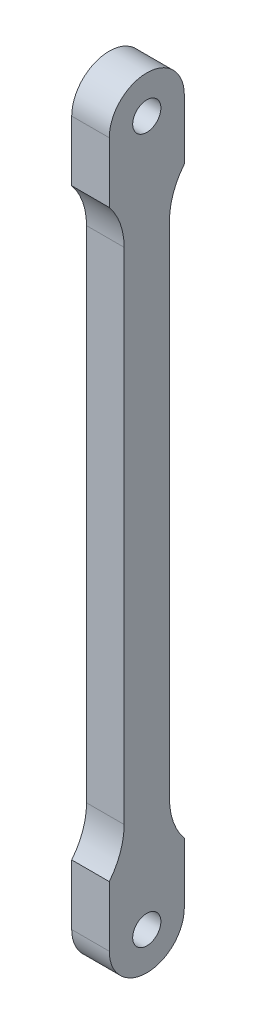
ISO-10303-21;
HEADER;
FILE_DESCRIPTION(('STEP AP214'),'2;1');
FILE_NAME('part.step','',(''),(''),'','','');
FILE_SCHEMA(('AUTOMOTIVE_DESIGN { 1 0 10303 214 1 1 1 1 }'));
ENDSEC;
DATA;
#1=APPLICATION_CONTEXT('core data for automotive mechanical design processes');
#2=APPLICATION_PROTOCOL_DEFINITION('international standard','automotive_design',2000,#1);
#3=PRODUCT_CONTEXT('',#1,'mechanical');
#4=PRODUCT('Part','Part','',(#3));
#5=PRODUCT_RELATED_PRODUCT_CATEGORY('part','',(#4));
#6=PRODUCT_DEFINITION_FORMATION('','',#4);
#7=PRODUCT_DEFINITION_CONTEXT('part definition',#1,'design');
#8=PRODUCT_DEFINITION('design','',#6,#7);
#9=PRODUCT_DEFINITION_SHAPE('','',#8);
#10=(LENGTH_UNIT() NAMED_UNIT(*) SI_UNIT(.MILLI.,.METRE.));
#11=(NAMED_UNIT(*) PLANE_ANGLE_UNIT() SI_UNIT($,.RADIAN.));
#12=(NAMED_UNIT(*) SI_UNIT($,.STERADIAN.) SOLID_ANGLE_UNIT());
#13=UNCERTAINTY_MEASURE_WITH_UNIT(LENGTH_MEASURE(1.E-05),#10,'distance_accuracy_value','');
#14=(GEOMETRIC_REPRESENTATION_CONTEXT(3) GLOBAL_UNCERTAINTY_ASSIGNED_CONTEXT((#13)) GLOBAL_UNIT_ASSIGNED_CONTEXT((#10,
#11,#12)) REPRESENTATION_CONTEXT('',''));
#15=CARTESIAN_POINT('',(0.,0.,0.));
#16=DIRECTION('',(0.,0.,1.));
#17=DIRECTION('',(1.,0.,0.));
#18=AXIS2_PLACEMENT_3D('',#15,#16,#17);
#19=CARTESIAN_POINT('',(13.,85.8493327642219,-30.7854400616336));
#20=DIRECTION('',(0.,0.,-1.));
#21=DIRECTION('',(0.,1.,0.));
#22=AXIS2_PLACEMENT_3D('',#19,#20,#21);
#23=PLANE('',#22);
#24=DIRECTION('',(0.,-1.,0.));
#25=VECTOR('',#24,1.);
#26=CARTESIAN_POINT('',(9.,85.8493327642219,-30.7854400616336));
#27=LINE('',#26,#25);
#28=CARTESIAN_POINT('',(9.,85.8493327642219,-30.7854400616336));
#29=VERTEX_POINT('',#28);
#30=CARTESIAN_POINT('',(9.,79.4265127290062,-30.7854400616336));
#31=VERTEX_POINT('',#30);
#32=EDGE_CURVE('E140',#29,#31,#27,.T.);
#33=ORIENTED_EDGE('',*,*,#32,.T.);
#34=DIRECTION('',(1.,0.,0.));
#35=VECTOR('',#34,1.);
#36=CARTESIAN_POINT('',(9.,79.4265127290062,-30.7854400616336));
#37=LINE('',#36,#35);
#38=CARTESIAN_POINT('',(13.,79.4265127290062,-30.7854400616336));
#39=VERTEX_POINT('',#38);
#40=EDGE_CURVE('E11',#31,#39,#37,.T.);
#41=ORIENTED_EDGE('',*,*,#40,.T.);
#42=DIRECTION('',(0.,-1.,0.));
#43=VECTOR('',#42,1.);
#44=CARTESIAN_POINT('',(13.,85.8493327642219,-30.7854400616336));
#45=LINE('',#44,#43);
#46=CARTESIAN_POINT('',(13.,85.8493327642219,-30.7854400616336));
#47=VERTEX_POINT('',#46);
#48=EDGE_CURVE('E198',#47,#39,#45,.T.);
#49=ORIENTED_EDGE('',*,*,#48,.F.);
#50=DIRECTION('',(-1.,0.,0.));
#51=VECTOR('',#50,1.);
#52=CARTESIAN_POINT('',(13.,85.8493327642219,-30.7854400616336));
#53=LINE('',#52,#51);
#54=EDGE_CURVE('E159',#47,#29,#53,.T.);
#55=ORIENTED_EDGE('',*,*,#54,.T.);
#56=EDGE_LOOP('',(#33,#41,#49,#55));
#57=FACE_BOUND('',#56,.T.);
#58=ADVANCED_FACE('F35',(#57),#23,.F.);
#59=CARTESIAN_POINT('',(13.,85.8493327642219,-38.7735888511973));
#60=DIRECTION('',(0.,0.,1.));
#61=DIRECTION('',(0.,-1.,0.));
#62=AXIS2_PLACEMENT_3D('',#59,#60,#61);
#63=PLANE('',#62);
#64=DIRECTION('',(0.,1.,0.));
#65=VECTOR('',#64,1.);
#66=CARTESIAN_POINT('',(13.,85.8493327642219,-38.7735888511973));
#67=LINE('',#66,#65);
#68=CARTESIAN_POINT('',(13.,79.4265127290062,-38.7735888511973));
#69=VERTEX_POINT('',#68);
#70=CARTESIAN_POINT('',(13.,85.8493327642219,-38.7735888511973));
#71=VERTEX_POINT('',#70);
#72=EDGE_CURVE('E201',#69,#71,#67,.T.);
#73=ORIENTED_EDGE('',*,*,#72,.F.);
#74=DIRECTION('',(1.,0.,0.));
#75=VECTOR('',#74,1.);
#76=CARTESIAN_POINT('',(9.,79.4265127290062,-38.7735888511973));
#77=LINE('',#76,#75);
#78=CARTESIAN_POINT('',(9.,79.4265127290062,-38.7735888511973));
#79=VERTEX_POINT('',#78);
#80=EDGE_CURVE('E120',#69,#79,#77,.F.);
#81=ORIENTED_EDGE('',*,*,#80,.T.);
#82=DIRECTION('',(0.,1.,0.));
#83=VECTOR('',#82,1.);
#84=CARTESIAN_POINT('',(9.,85.8493327642219,-38.7735888511973));
#85=LINE('',#84,#83);
#86=CARTESIAN_POINT('',(9.,85.8493327642219,-38.7735888511973));
#87=VERTEX_POINT('',#86);
#88=EDGE_CURVE('E113',#79,#87,#85,.T.);
#89=ORIENTED_EDGE('',*,*,#88,.T.);
#90=DIRECTION('',(-1.,0.,0.));
#91=VECTOR('',#90,1.);
#92=CARTESIAN_POINT('',(13.,85.8493327642219,-38.7735888511973));
#93=LINE('',#92,#91);
#94=EDGE_CURVE('E117',#71,#87,#93,.T.);
#95=ORIENTED_EDGE('',*,*,#94,.F.);
#96=EDGE_LOOP('',(#73,#81,#89,#95));
#97=FACE_BOUND('',#96,.T.);
#98=ADVANCED_FACE('F116',(#97),#63,.F.);
#99=CARTESIAN_POINT('',(13.,85.8493327642219,-34.7795144564155));
#100=DIRECTION('',(1.,0.,0.));
#101=DIRECTION('',(0.,0.,-1.));
#102=AXIS2_PLACEMENT_3D('',#99,#100,#101);
#103=PLANE('',#102);
#104=CARTESIAN_POINT('',(13.,74.9571407033181,-25.2691190078651));
#105=DIRECTION('',(1.,0.,0.));
#106=DIRECTION('',(0.,0.,-1.));
#107=AXIS2_PLACEMENT_3D('',#104,#105,#106);
#108=CIRCLE('',#107,7.09965381354982);
#109=CARTESIAN_POINT('',(13.,74.9571407033181,-32.3687728214149));
#110=VERTEX_POINT('',#109);
#111=EDGE_CURVE('E172',#110,#39,#108,.T.);
#112=ORIENTED_EDGE('',*,*,#111,.F.);
#113=DIRECTION('',(0.,1.,0.));
#114=VECTOR('',#113,1.);
#115=CARTESIAN_POINT('',(13.,74.9571407033181,-32.3687728214149));
#116=LINE('',#115,#114);
#117=CARTESIAN_POINT('',(13.,21.7415248251257,-32.3687728214149));
#118=VERTEX_POINT('',#117);
#119=EDGE_CURVE('E39',#118,#110,#116,.T.);
#120=ORIENTED_EDGE('',*,*,#119,.F.);
#121=CARTESIAN_POINT('',(13.,21.7415248251257,-25.2691190078651));
#122=DIRECTION('',(1.,0.,0.));
#123=DIRECTION('',(0.,0.,-1.));
#124=AXIS2_PLACEMENT_3D('',#121,#122,#123);
#125=CIRCLE('',#124,7.09965381354981);
#126=CARTESIAN_POINT('',(13.,17.2721527994377,-30.7854400616336));
#127=VERTEX_POINT('',#126);
#128=EDGE_CURVE('E73',#127,#118,#125,.T.);
#129=ORIENTED_EDGE('',*,*,#128,.F.);
#130=CARTESIAN_POINT('',(13.,10.8493327642219,-30.7854400616336));
#131=VERTEX_POINT('',#130);
#132=EDGE_CURVE('E197',#127,#131,#45,.T.);
#133=ORIENTED_EDGE('',*,*,#132,.T.);
#134=CARTESIAN_POINT('',(13.,10.8493327642219,-34.7795144564155));
#135=DIRECTION('',(1.,0.,0.));
#136=DIRECTION('',(0.,0.,-1.));
#137=AXIS2_PLACEMENT_3D('',#134,#135,#136);
#138=CIRCLE('',#137,3.99407439478185);
#139=CARTESIAN_POINT('',(13.,10.8493327642219,-38.7735888511973));
#140=VERTEX_POINT('',#139);
#141=EDGE_CURVE('E200',#131,#140,#138,.T.);
#142=ORIENTED_EDGE('',*,*,#141,.T.);
#143=CARTESIAN_POINT('',(13.,17.2721527994377,-38.7735888511973));
#144=VERTEX_POINT('',#143);
#145=EDGE_CURVE('E134',#140,#144,#67,.T.);
#146=ORIENTED_EDGE('',*,*,#145,.T.);
#147=CARTESIAN_POINT('',(13.,21.7415248251257,-44.2899099049658));
#148=DIRECTION('',(1.,0.,0.));
#149=DIRECTION('',(0.,0.,-1.));
#150=AXIS2_PLACEMENT_3D('',#147,#148,#149);
#151=CIRCLE('',#150,7.09965381354981);
#152=CARTESIAN_POINT('',(13.,21.7415248251257,-37.190256091416));
#153=VERTEX_POINT('',#152);
#154=EDGE_CURVE('E166',#153,#144,#151,.T.);
#155=ORIENTED_EDGE('',*,*,#154,.F.);
#156=DIRECTION('',(0.,-1.,0.));
#157=VECTOR('',#156,1.);
#158=CARTESIAN_POINT('',(13.,74.9571407033181,-37.190256091416));
#159=LINE('',#158,#157);
#160=CARTESIAN_POINT('',(13.,74.9571407033181,-37.190256091416));
#161=VERTEX_POINT('',#160);
#162=EDGE_CURVE('E173',#161,#153,#159,.T.);
#163=ORIENTED_EDGE('',*,*,#162,.F.);
#164=CARTESIAN_POINT('',(13.,74.9571407033181,-44.2899099049658));
#165=DIRECTION('',(1.,0.,0.));
#166=DIRECTION('',(0.,0.,-1.));
#167=AXIS2_PLACEMENT_3D('',#164,#165,#166);
#168=CIRCLE('',#167,7.09965381354982);
#169=EDGE_CURVE('E168',#69,#161,#168,.T.);
#170=ORIENTED_EDGE('',*,*,#169,.F.);
#171=ORIENTED_EDGE('',*,*,#72,.T.);
#172=CARTESIAN_POINT('',(13.,85.8493327642219,-34.7795144564155));
#173=DIRECTION('',(1.,0.,0.));
#174=DIRECTION('',(0.,0.,-1.));
#175=AXIS2_PLACEMENT_3D('',#172,#173,#174);
#176=CIRCLE('',#175,3.99407439478185);
#177=EDGE_CURVE('E132',#71,#47,#176,.T.);
#178=ORIENTED_EDGE('',*,*,#177,.T.);
#179=ORIENTED_EDGE('',*,*,#48,.T.);
#180=EDGE_LOOP('',(#112,#120,#129,#133,#142,#146,#155,#163,#170,#171,#178,#179));
#181=FACE_BOUND('',#180,.T.);
#182=CARTESIAN_POINT('',(13.,85.8493327642219,-34.7795144564155));
#183=DIRECTION('',(1.,0.,0.));
#184=DIRECTION('',(0.,0.,-1.));
#185=AXIS2_PLACEMENT_3D('',#182,#183,#184);
#186=CIRCLE('',#185,1.5);
#187=CARTESIAN_POINT('',(13.,85.8493327642219,-36.2795144564155));
#188=VERTEX_POINT('',#187);
#189=EDGE_CURVE('E143',#188,#188,#186,.T.);
#190=ORIENTED_EDGE('',*,*,#189,.F.);
#191=EDGE_LOOP('',(#190));
#192=FACE_BOUND('',#191,.T.);
#193=CARTESIAN_POINT('',(13.,10.8493327642219,-34.7795144564155));
#194=DIRECTION('',(1.,0.,0.));
#195=DIRECTION('',(0.,0.,-1.));
#196=AXIS2_PLACEMENT_3D('',#193,#194,#195);
#197=CIRCLE('',#196,1.5);
#198=CARTESIAN_POINT('',(13.,10.8493327642219,-36.2795144564155));
#199=VERTEX_POINT('',#198);
#200=EDGE_CURVE('E186',#199,#199,#197,.T.);
#201=ORIENTED_EDGE('',*,*,#200,.F.);
#202=EDGE_LOOP('',(#201));
#203=FACE_BOUND('',#202,.T.);
#204=ADVANCED_FACE('F210',(#181,#192,#203),#103,.T.);
#205=CARTESIAN_POINT('',(9.,85.8493327642219,-34.7795144564155));
#206=DIRECTION('',(1.,0.,0.));
#207=DIRECTION('',(0.,0.,-1.));
#208=AXIS2_PLACEMENT_3D('',#205,#206,#207);
#209=PLANE('',#208);
#210=DIRECTION('',(0.,1.,0.));
#211=VECTOR('',#210,1.);
#212=CARTESIAN_POINT('',(9.,74.9571407033181,-32.3687728214149));
#213=LINE('',#212,#211);
#214=CARTESIAN_POINT('',(9.,21.7415248251257,-32.3687728214149));
#215=VERTEX_POINT('',#214);
#216=CARTESIAN_POINT('',(9.,74.9571407033181,-32.3687728214149));
#217=VERTEX_POINT('',#216);
#218=EDGE_CURVE('E235',#215,#217,#213,.T.);
#219=ORIENTED_EDGE('',*,*,#218,.T.);
#220=CARTESIAN_POINT('',(9.,74.9571407033181,-25.2691190078651));
#221=DIRECTION('',(1.,0.,0.));
#222=DIRECTION('',(0.,0.,-1.));
#223=AXIS2_PLACEMENT_3D('',#220,#221,#222);
#224=CIRCLE('',#223,7.09965381354982);
#225=EDGE_CURVE('E233',#217,#31,#224,.T.);
#226=ORIENTED_EDGE('',*,*,#225,.T.);
#227=ORIENTED_EDGE('',*,*,#32,.F.);
#228=CARTESIAN_POINT('',(9.,85.8493327642219,-34.7795144564155));
#229=DIRECTION('',(1.,0.,0.));
#230=DIRECTION('',(0.,0.,-1.));
#231=AXIS2_PLACEMENT_3D('',#228,#229,#230);
#232=CIRCLE('',#231,3.99407439478185);
#233=EDGE_CURVE('E130',#87,#29,#232,.T.);
#234=ORIENTED_EDGE('',*,*,#233,.F.);
#235=ORIENTED_EDGE('',*,*,#88,.F.);
#236=CARTESIAN_POINT('',(9.,74.9571407033181,-44.2899099049658));
#237=DIRECTION('',(1.,0.,0.));
#238=DIRECTION('',(0.,0.,1.));
#239=AXIS2_PLACEMENT_3D('',#236,#237,#238);
#240=CIRCLE('',#239,7.09965381354982);
#241=CARTESIAN_POINT('',(9.,74.9571407033181,-37.190256091416));
#242=VERTEX_POINT('',#241);
#243=EDGE_CURVE('E230',#79,#242,#240,.T.);
#244=ORIENTED_EDGE('',*,*,#243,.T.);
#245=DIRECTION('',(0.,-1.,0.));
#246=VECTOR('',#245,1.);
#247=CARTESIAN_POINT('',(9.,74.9571407033181,-37.190256091416));
#248=LINE('',#247,#246);
#249=CARTESIAN_POINT('',(9.,21.7415248251257,-37.190256091416));
#250=VERTEX_POINT('',#249);
#251=EDGE_CURVE('E225',#242,#250,#248,.T.);
#252=ORIENTED_EDGE('',*,*,#251,.T.);
#253=CARTESIAN_POINT('',(9.,21.7415248251257,-44.2899099049658));
#254=DIRECTION('',(1.,0.,0.));
#255=DIRECTION('',(0.,0.,1.));
#256=AXIS2_PLACEMENT_3D('',#253,#254,#255);
#257=CIRCLE('',#256,7.09965381354981);
#258=CARTESIAN_POINT('',(9.,17.2721527994377,-38.7735888511973));
#259=VERTEX_POINT('',#258);
#260=EDGE_CURVE('E221',#250,#259,#257,.T.);
#261=ORIENTED_EDGE('',*,*,#260,.T.);
#262=CARTESIAN_POINT('',(9.,10.8493327642219,-38.7735888511973));
#263=VERTEX_POINT('',#262);
#264=EDGE_CURVE('E124',#263,#259,#85,.T.);
#265=ORIENTED_EDGE('',*,*,#264,.F.);
#266=CARTESIAN_POINT('',(9.,10.8493327642219,-34.7795144564155));
#267=DIRECTION('',(1.,0.,0.));
#268=DIRECTION('',(0.,0.,-1.));
#269=AXIS2_PLACEMENT_3D('',#266,#267,#268);
#270=CIRCLE('',#269,3.99407439478185);
#271=CARTESIAN_POINT('',(9.,10.8493327642219,-30.7854400616336));
#272=VERTEX_POINT('',#271);
#273=EDGE_CURVE('E125',#272,#263,#270,.T.);
#274=ORIENTED_EDGE('',*,*,#273,.F.);
#275=CARTESIAN_POINT('',(9.,17.2721527994377,-30.7854400616336));
#276=VERTEX_POINT('',#275);
#277=EDGE_CURVE('E142',#276,#272,#27,.T.);
#278=ORIENTED_EDGE('',*,*,#277,.F.);
#279=CARTESIAN_POINT('',(9.,21.7415248251257,-25.2691190078651));
#280=DIRECTION('',(1.,0.,0.));
#281=DIRECTION('',(0.,0.,-1.));
#282=AXIS2_PLACEMENT_3D('',#279,#280,#281);
#283=CIRCLE('',#282,7.09965381354981);
#284=EDGE_CURVE('E54',#276,#215,#283,.T.);
#285=ORIENTED_EDGE('',*,*,#284,.T.);
#286=EDGE_LOOP('',(#219,#226,#227,#234,#235,#244,#252,#261,#265,#274,#278,#285));
#287=FACE_BOUND('',#286,.T.);
#288=CARTESIAN_POINT('',(9.,85.8493327642219,-34.7795144564155));
#289=DIRECTION('',(1.,0.,0.));
#290=DIRECTION('',(0.,0.,-1.));
#291=AXIS2_PLACEMENT_3D('',#288,#289,#290);
#292=CIRCLE('',#291,1.5);
#293=CARTESIAN_POINT('',(9.,85.8493327642219,-36.2795144564155));
#294=VERTEX_POINT('',#293);
#295=EDGE_CURVE('E147',#294,#294,#292,.T.);
#296=ORIENTED_EDGE('',*,*,#295,.T.);
#297=EDGE_LOOP('',(#296));
#298=FACE_BOUND('',#297,.T.);
#299=CARTESIAN_POINT('',(9.,10.8493327642219,-34.7795144564155));
#300=DIRECTION('',(1.,0.,0.));
#301=DIRECTION('',(0.,0.,-1.));
#302=AXIS2_PLACEMENT_3D('',#299,#300,#301);
#303=CIRCLE('',#302,1.5);
#304=CARTESIAN_POINT('',(9.,10.8493327642219,-36.2795144564155));
#305=VERTEX_POINT('',#304);
#306=EDGE_CURVE('E180',#305,#305,#303,.T.);
#307=ORIENTED_EDGE('',*,*,#306,.T.);
#308=EDGE_LOOP('',(#307));
#309=FACE_BOUND('',#308,.T.);
#310=ADVANCED_FACE('F137',(#287,#298,#309),#209,.F.);
#311=CARTESIAN_POINT('',(13.,85.8493327642219,-34.7795144564155));
#312=DIRECTION('',(-1.,0.,0.));
#313=DIRECTION('',(0.,0.,1.));
#314=AXIS2_PLACEMENT_3D('',#311,#312,#313);
#315=CYLINDRICAL_SURFACE('',#314,3.99407439478185);
#316=ORIENTED_EDGE('',*,*,#233,.T.);
#317=ORIENTED_EDGE('',*,*,#54,.F.);
#318=ORIENTED_EDGE('',*,*,#177,.F.);
#319=ORIENTED_EDGE('',*,*,#94,.T.);
#320=EDGE_LOOP('',(#316,#317,#318,#319));
#321=FACE_BOUND('',#320,.T.);
#322=ADVANCED_FACE('F37',(#321),#315,.T.);
#323=ORIENTED_EDGE('',*,*,#132,.F.);
#324=DIRECTION('',(1.,0.,0.));
#325=VECTOR('',#324,1.);
#326=CARTESIAN_POINT('',(9.,17.2721527994377,-30.7854400616336));
#327=LINE('',#326,#325);
#328=EDGE_CURVE('E45',#127,#276,#327,.F.);
#329=ORIENTED_EDGE('',*,*,#328,.T.);
#330=ORIENTED_EDGE('',*,*,#277,.T.);
#331=DIRECTION('',(-1.,0.,0.));
#332=VECTOR('',#331,1.);
#333=CARTESIAN_POINT('',(13.,10.8493327642219,-30.7854400616336));
#334=LINE('',#333,#332);
#335=EDGE_CURVE('E156',#131,#272,#334,.T.);
#336=ORIENTED_EDGE('',*,*,#335,.F.);
#337=EDGE_LOOP('',(#323,#329,#330,#336));
#338=FACE_BOUND('',#337,.T.);
#339=ADVANCED_FACE('F260',(#338),#23,.F.);
#340=CARTESIAN_POINT('',(13.,10.8493327642219,-34.7795144564155));
#341=DIRECTION('',(-1.,0.,0.));
#342=DIRECTION('',(0.,0.,1.));
#343=AXIS2_PLACEMENT_3D('',#340,#341,#342);
#344=CYLINDRICAL_SURFACE('',#343,3.99407439478185);
#345=ORIENTED_EDGE('',*,*,#273,.T.);
#346=DIRECTION('',(-1.,0.,0.));
#347=VECTOR('',#346,1.);
#348=CARTESIAN_POINT('',(13.,10.8493327642219,-38.7735888511973));
#349=LINE('',#348,#347);
#350=EDGE_CURVE('E133',#140,#263,#349,.T.);
#351=ORIENTED_EDGE('',*,*,#350,.F.);
#352=ORIENTED_EDGE('',*,*,#141,.F.);
#353=ORIENTED_EDGE('',*,*,#335,.T.);
#354=EDGE_LOOP('',(#345,#351,#352,#353));
#355=FACE_BOUND('',#354,.T.);
#356=ADVANCED_FACE('F262',(#355),#344,.T.);
#357=ORIENTED_EDGE('',*,*,#264,.T.);
#358=DIRECTION('',(1.,0.,0.));
#359=VECTOR('',#358,1.);
#360=CARTESIAN_POINT('',(9.,17.2721527994377,-38.7735888511973));
#361=LINE('',#360,#359);
#362=EDGE_CURVE('E161',#259,#144,#361,.T.);
#363=ORIENTED_EDGE('',*,*,#362,.T.);
#364=ORIENTED_EDGE('',*,*,#145,.F.);
#365=ORIENTED_EDGE('',*,*,#350,.T.);
#366=EDGE_LOOP('',(#357,#363,#364,#365));
#367=FACE_BOUND('',#366,.T.);
#368=ADVANCED_FACE('F213',(#367),#63,.F.);
#369=CARTESIAN_POINT('',(13.,85.8493327642219,-34.7795144564155));
#370=DIRECTION('',(-1.,0.,0.));
#371=DIRECTION('',(0.,0.,1.));
#372=AXIS2_PLACEMENT_3D('',#369,#370,#371);
#373=CYLINDRICAL_SURFACE('',#372,1.5);
#374=ORIENTED_EDGE('',*,*,#189,.T.);
#375=EDGE_LOOP('',(#374));
#376=FACE_BOUND('',#375,.T.);
#377=ORIENTED_EDGE('',*,*,#295,.F.);
#378=EDGE_LOOP('',(#377));
#379=FACE_BOUND('',#378,.T.);
#380=ADVANCED_FACE('F269',(#376,#379),#373,.F.);
#381=CARTESIAN_POINT('',(13.,10.8493327642219,-34.7795144564155));
#382=DIRECTION('',(-1.,0.,0.));
#383=DIRECTION('',(0.,0.,1.));
#384=AXIS2_PLACEMENT_3D('',#381,#382,#383);
#385=CYLINDRICAL_SURFACE('',#384,1.5);
#386=ORIENTED_EDGE('',*,*,#200,.T.);
#387=EDGE_LOOP('',(#386));
#388=FACE_BOUND('',#387,.T.);
#389=ORIENTED_EDGE('',*,*,#306,.F.);
#390=EDGE_LOOP('',(#389));
#391=FACE_BOUND('',#390,.T.);
#392=ADVANCED_FACE('F292',(#388,#391),#385,.F.);
#393=CARTESIAN_POINT('',(9.,74.9571407033181,-44.2899099049658));
#394=DIRECTION('',(1.,0.,0.));
#395=DIRECTION('',(0.,0.,-1.));
#396=AXIS2_PLACEMENT_3D('',#393,#394,#395);
#397=CYLINDRICAL_SURFACE('',#396,7.09965381354982);
#398=ORIENTED_EDGE('',*,*,#169,.T.);
#399=DIRECTION('',(1.,0.,0.));
#400=VECTOR('',#399,1.);
#401=CARTESIAN_POINT('',(9.,74.9571407033181,-37.190256091416));
#402=LINE('',#401,#400);
#403=EDGE_CURVE('E226',#242,#161,#402,.T.);
#404=ORIENTED_EDGE('',*,*,#403,.F.);
#405=ORIENTED_EDGE('',*,*,#243,.F.);
#406=ORIENTED_EDGE('',*,*,#80,.F.);
#407=EDGE_LOOP('',(#398,#404,#405,#406));
#408=FACE_BOUND('',#407,.T.);
#409=ADVANCED_FACE('F246',(#408),#397,.F.);
#410=CARTESIAN_POINT('',(9.,21.7415248251257,-44.2899099049658));
#411=DIRECTION('',(1.,0.,0.));
#412=DIRECTION('',(0.,0.,-1.));
#413=AXIS2_PLACEMENT_3D('',#410,#411,#412);
#414=CYLINDRICAL_SURFACE('',#413,7.09965381354981);
#415=ORIENTED_EDGE('',*,*,#154,.T.);
#416=ORIENTED_EDGE('',*,*,#362,.F.);
#417=ORIENTED_EDGE('',*,*,#260,.F.);
#418=DIRECTION('',(1.,0.,0.));
#419=VECTOR('',#418,1.);
#420=CARTESIAN_POINT('',(9.,21.7415248251257,-37.190256091416));
#421=LINE('',#420,#419);
#422=EDGE_CURVE('E228',#250,#153,#421,.T.);
#423=ORIENTED_EDGE('',*,*,#422,.T.);
#424=EDGE_LOOP('',(#415,#416,#417,#423));
#425=FACE_BOUND('',#424,.T.);
#426=ADVANCED_FACE('F219',(#425),#414,.F.);
#427=CARTESIAN_POINT('',(9.,74.9571407033181,-37.190256091416));
#428=DIRECTION('',(0.,0.,1.));
#429=DIRECTION('',(0.,-1.,0.));
#430=AXIS2_PLACEMENT_3D('',#427,#428,#429);
#431=PLANE('',#430);
#432=ORIENTED_EDGE('',*,*,#162,.T.);
#433=ORIENTED_EDGE('',*,*,#422,.F.);
#434=ORIENTED_EDGE('',*,*,#251,.F.);
#435=ORIENTED_EDGE('',*,*,#403,.T.);
#436=EDGE_LOOP('',(#432,#433,#434,#435));
#437=FACE_BOUND('',#436,.T.);
#438=ADVANCED_FACE('F278',(#437),#431,.F.);
#439=CARTESIAN_POINT('',(9.,74.9571407033181,-25.2691190078651));
#440=DIRECTION('',(1.,0.,0.));
#441=DIRECTION('',(0.,0.,-1.));
#442=AXIS2_PLACEMENT_3D('',#439,#440,#441);
#443=CYLINDRICAL_SURFACE('',#442,7.09965381354982);
#444=ORIENTED_EDGE('',*,*,#111,.T.);
#445=ORIENTED_EDGE('',*,*,#40,.F.);
#446=ORIENTED_EDGE('',*,*,#225,.F.);
#447=DIRECTION('',(1.,0.,0.));
#448=VECTOR('',#447,1.);
#449=CARTESIAN_POINT('',(9.,74.9571407033181,-32.3687728214149));
#450=LINE('',#449,#448);
#451=EDGE_CURVE('E169',#217,#110,#450,.T.);
#452=ORIENTED_EDGE('',*,*,#451,.T.);
#453=EDGE_LOOP('',(#444,#445,#446,#452));
#454=FACE_BOUND('',#453,.T.);
#455=ADVANCED_FACE('F276',(#454),#443,.F.);
#456=CARTESIAN_POINT('',(9.,74.9571407033181,-32.3687728214149));
#457=DIRECTION('',(0.,0.,-1.));
#458=DIRECTION('',(0.,1.,0.));
#459=AXIS2_PLACEMENT_3D('',#456,#457,#458);
#460=PLANE('',#459);
#461=ORIENTED_EDGE('',*,*,#119,.T.);
#462=ORIENTED_EDGE('',*,*,#451,.F.);
#463=ORIENTED_EDGE('',*,*,#218,.F.);
#464=DIRECTION('',(1.,0.,0.));
#465=VECTOR('',#464,1.);
#466=CARTESIAN_POINT('',(9.,21.7415248251257,-32.3687728214149));
#467=LINE('',#466,#465);
#468=EDGE_CURVE('E239',#215,#118,#467,.T.);
#469=ORIENTED_EDGE('',*,*,#468,.T.);
#470=EDGE_LOOP('',(#461,#462,#463,#469));
#471=FACE_BOUND('',#470,.T.);
#472=ADVANCED_FACE('F255',(#471),#460,.F.);
#473=CARTESIAN_POINT('',(9.,21.7415248251257,-25.2691190078651));
#474=DIRECTION('',(1.,0.,0.));
#475=DIRECTION('',(0.,0.,-1.));
#476=AXIS2_PLACEMENT_3D('',#473,#474,#475);
#477=CYLINDRICAL_SURFACE('',#476,7.09965381354981);
#478=ORIENTED_EDGE('',*,*,#128,.T.);
#479=ORIENTED_EDGE('',*,*,#468,.F.);
#480=ORIENTED_EDGE('',*,*,#284,.F.);
#481=ORIENTED_EDGE('',*,*,#328,.F.);
#482=EDGE_LOOP('',(#478,#479,#480,#481));
#483=FACE_BOUND('',#482,.T.);
#484=ADVANCED_FACE('F254',(#483),#477,.F.);
#485=CLOSED_SHELL('',(#58,#98,#204,#310,#322,#339,#356,#368,#380,#392,#409,#426,#438,#455,#472,#484));
#486=MANIFOLD_SOLID_BREP('B2',#485);
#487=ADVANCED_BREP_SHAPE_REPRESENTATION('',(#18,#486),#14);
#488=SHAPE_DEFINITION_REPRESENTATION(#9,#487);
ENDSEC;
END-ISO-10303-21;
